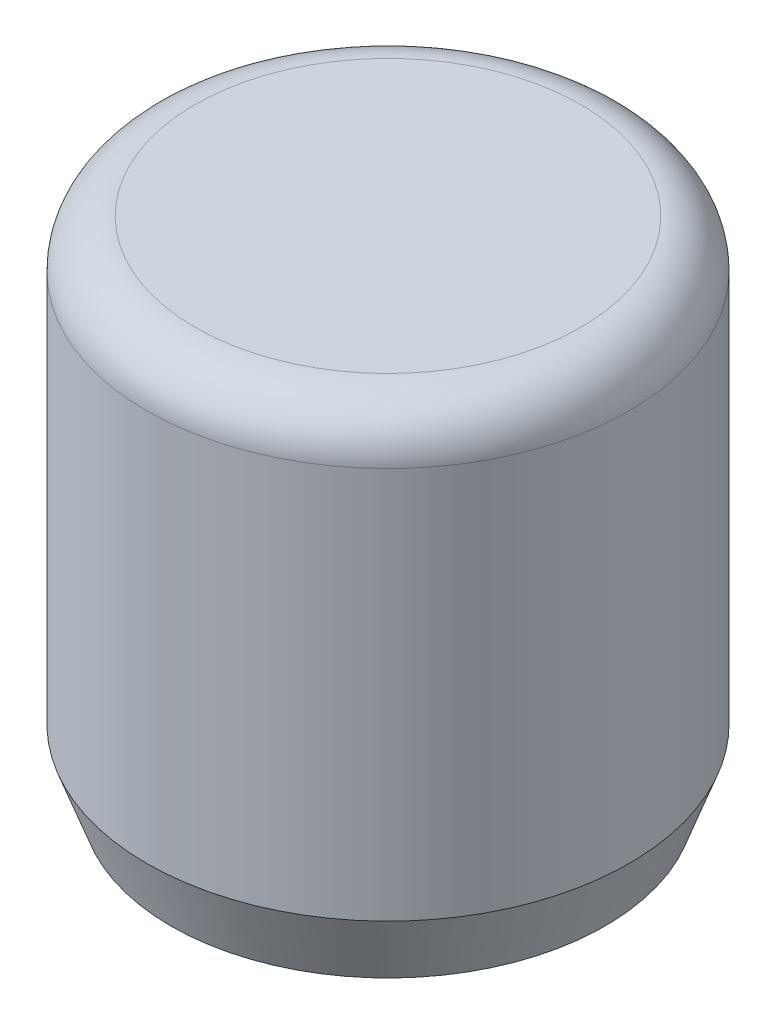
ISO-10303-21;
HEADER;
FILE_DESCRIPTION(('STEP AP214'),'2;1');
FILE_NAME('part.step','',(''),(''),'','','');
FILE_SCHEMA(('AUTOMOTIVE_DESIGN { 1 0 10303 214 1 1 1 1 }'));
ENDSEC;
DATA;
#1=APPLICATION_CONTEXT('core data for automotive mechanical design processes');
#2=APPLICATION_PROTOCOL_DEFINITION('international standard','automotive_design',2000,#1);
#3=PRODUCT_CONTEXT('',#1,'mechanical');
#4=PRODUCT('Part','Part','',(#3));
#5=PRODUCT_RELATED_PRODUCT_CATEGORY('part','',(#4));
#6=PRODUCT_DEFINITION_FORMATION('','',#4);
#7=PRODUCT_DEFINITION_CONTEXT('part definition',#1,'design');
#8=PRODUCT_DEFINITION('design','',#6,#7);
#9=PRODUCT_DEFINITION_SHAPE('','',#8);
#10=(LENGTH_UNIT() NAMED_UNIT(*) SI_UNIT(.MILLI.,.METRE.));
#11=(NAMED_UNIT(*) PLANE_ANGLE_UNIT() SI_UNIT($,.RADIAN.));
#12=(NAMED_UNIT(*) SI_UNIT($,.STERADIAN.) SOLID_ANGLE_UNIT());
#13=UNCERTAINTY_MEASURE_WITH_UNIT(LENGTH_MEASURE(1.E-05),#10,'distance_accuracy_value','');
#14=(GEOMETRIC_REPRESENTATION_CONTEXT(3) GLOBAL_UNCERTAINTY_ASSIGNED_CONTEXT((#13)) GLOBAL_UNIT_ASSIGNED_CONTEXT((#10,
#11,#12)) REPRESENTATION_CONTEXT('',''));
#15=CARTESIAN_POINT('',(0.,0.,0.));
#16=DIRECTION('',(0.,0.,1.));
#17=DIRECTION('',(1.,0.,0.));
#18=AXIS2_PLACEMENT_3D('',#15,#16,#17);
#19=CARTESIAN_POINT('',(0.,10.5,0.));
#20=DIRECTION('',(0.,-1.,0.));
#21=DIRECTION('',(0.,0.,-1.));
#22=AXIS2_PLACEMENT_3D('',#19,#20,#21);
#23=CYLINDRICAL_SURFACE('',#22,5.);
#24=CARTESIAN_POINT('',(0.,1.37373870972737,0.));
#25=DIRECTION('',(0.,1.,0.));
#26=DIRECTION('',(0.,0.,1.));
#27=AXIS2_PLACEMENT_3D('',#24,#25,#26);
#28=CIRCLE('',#27,5.);
#29=CARTESIAN_POINT('',(0.,1.37373870972737,5.));
#30=VERTEX_POINT('',#29);
#31=EDGE_CURVE('E40',#30,#30,#28,.T.);
#32=ORIENTED_EDGE('',*,*,#31,.T.);
#33=EDGE_LOOP('',(#32));
#34=FACE_BOUND('',#33,.T.);
#35=CARTESIAN_POINT('',(0.,9.5,0.));
#36=DIRECTION('',(0.,1.,0.));
#37=DIRECTION('',(0.,0.,1.));
#38=AXIS2_PLACEMENT_3D('',#35,#36,#37);
#39=CIRCLE('',#38,5.);
#40=CARTESIAN_POINT('',(0.,9.5,5.));
#41=VERTEX_POINT('',#40);
#42=EDGE_CURVE('E44',#41,#41,#39,.F.);
#43=ORIENTED_EDGE('',*,*,#42,.T.);
#44=EDGE_LOOP('',(#43));
#45=FACE_BOUND('',#44,.T.);
#46=ADVANCED_FACE('F33',(#34,#45),#23,.T.);
#47=CARTESIAN_POINT('',(0.,10.5,0.));
#48=DIRECTION('',(0.,1.,0.));
#49=DIRECTION('',(0.,0.,1.));
#50=AXIS2_PLACEMENT_3D('',#47,#48,#49);
#51=PLANE('',#50);
#52=CARTESIAN_POINT('',(0.,10.5,0.));
#53=DIRECTION('',(0.,1.,0.));
#54=DIRECTION('',(0.,0.,1.));
#55=AXIS2_PLACEMENT_3D('',#52,#53,#54);
#56=CIRCLE('',#55,4.);
#57=CARTESIAN_POINT('',(0.,10.5,4.));
#58=VERTEX_POINT('',#57);
#59=EDGE_CURVE('E48',#58,#58,#56,.T.);
#60=ORIENTED_EDGE('',*,*,#59,.T.);
#61=EDGE_LOOP('',(#60));
#62=FACE_BOUND('',#61,.T.);
#63=ADVANCED_FACE('F70',(#62),#51,.T.);
#64=CARTESIAN_POINT('',(0.,0.,0.));
#65=DIRECTION('',(0.,1.,0.));
#66=DIRECTION('',(0.,0.,1.));
#67=AXIS2_PLACEMENT_3D('',#64,#65,#66);
#68=PLANE('',#67);
#69=CARTESIAN_POINT('',(0.,0.,0.));
#70=DIRECTION('',(0.,1.,0.));
#71=DIRECTION('',(0.,0.,1.));
#72=AXIS2_PLACEMENT_3D('',#69,#70,#71);
#73=CIRCLE('',#72,4.49999999999998);
#74=CARTESIAN_POINT('',(0.,0.,4.49999999999998));
#75=VERTEX_POINT('',#74);
#76=EDGE_CURVE('E10',#75,#75,#73,.F.);
#77=ORIENTED_EDGE('',*,*,#76,.T.);
#78=EDGE_LOOP('',(#77));
#79=FACE_BOUND('',#78,.T.);
#80=CARTESIAN_POINT('',(0.,0.,0.));
#81=DIRECTION('',(0.,-1.,0.));
#82=DIRECTION('',(0.,0.,-1.));
#83=AXIS2_PLACEMENT_3D('',#80,#81,#82);
#84=CIRCLE('',#83,3.);
#85=CARTESIAN_POINT('',(0.,0.,-3.));
#86=VERTEX_POINT('',#85);
#87=EDGE_CURVE('E54',#86,#86,#84,.T.);
#88=ORIENTED_EDGE('',*,*,#87,.F.);
#89=EDGE_LOOP('',(#88));
#90=FACE_BOUND('',#89,.T.);
#91=ADVANCED_FACE('F65',(#79,#90),#68,.F.);
#92=CARTESIAN_POINT('',(0.,6.,0.));
#93=DIRECTION('',(0.,-1.,0.));
#94=DIRECTION('',(0.,0.,-1.));
#95=AXIS2_PLACEMENT_3D('',#92,#93,#94);
#96=CYLINDRICAL_SURFACE('',#95,3.);
#97=CARTESIAN_POINT('',(0.,6.,0.));
#98=DIRECTION('',(0.,-1.,0.));
#99=DIRECTION('',(0.,0.,-1.));
#100=AXIS2_PLACEMENT_3D('',#97,#98,#99);
#101=CIRCLE('',#100,3.);
#102=CARTESIAN_POINT('',(0.,6.,-3.));
#103=VERTEX_POINT('',#102);
#104=EDGE_CURVE('E53',#103,#103,#101,.T.);
#105=ORIENTED_EDGE('',*,*,#104,.F.);
#106=EDGE_LOOP('',(#105));
#107=FACE_BOUND('',#106,.T.);
#108=ORIENTED_EDGE('',*,*,#87,.T.);
#109=EDGE_LOOP('',(#108));
#110=FACE_BOUND('',#109,.T.);
#111=ADVANCED_FACE('F62',(#107,#110),#96,.F.);
#112=CARTESIAN_POINT('',(0.,6.,0.));
#113=DIRECTION('',(0.,-1.,0.));
#114=DIRECTION('',(0.,0.,-1.));
#115=AXIS2_PLACEMENT_3D('',#112,#113,#114);
#116=PLANE('',#115);
#117=ORIENTED_EDGE('',*,*,#104,.T.);
#118=EDGE_LOOP('',(#117));
#119=FACE_BOUND('',#118,.T.);
#120=ADVANCED_FACE('F60',(#119),#116,.T.);
#121=CARTESIAN_POINT('',(0.,9.5,0.));
#122=DIRECTION('',(0.,1.,0.));
#123=DIRECTION('',(0.,0.,1.));
#124=AXIS2_PLACEMENT_3D('',#121,#122,#123);
#125=TOROIDAL_SURFACE('',#124,4.,1.);
#126=ORIENTED_EDGE('',*,*,#42,.F.);
#127=EDGE_LOOP('',(#126));
#128=FACE_BOUND('',#127,.T.);
#129=ORIENTED_EDGE('',*,*,#59,.F.);
#130=EDGE_LOOP('',(#129));
#131=FACE_BOUND('',#130,.T.);
#132=ADVANCED_FACE('F82',(#128,#131),#125,.T.);
#133=CARTESIAN_POINT('',(0.,1.37373870972737,0.));
#134=DIRECTION('',(0.,1.,0.));
#135=DIRECTION('',(0.,0.,1.));
#136=AXIS2_PLACEMENT_3D('',#133,#134,#135);
#137=CONICAL_SURFACE('',#136,5.,0.349065850398866);
#138=ORIENTED_EDGE('',*,*,#76,.F.);
#139=EDGE_LOOP('',(#138));
#140=FACE_BOUND('',#139,.T.);
#141=ORIENTED_EDGE('',*,*,#31,.F.);
#142=EDGE_LOOP('',(#141));
#143=FACE_BOUND('',#142,.T.);
#144=ADVANCED_FACE('F35',(#140,#143),#137,.T.);
#145=CLOSED_SHELL('',(#46,#63,#91,#111,#120,#132,#144));
#146=MANIFOLD_SOLID_BREP('B2',#145);
#147=ADVANCED_BREP_SHAPE_REPRESENTATION('',(#18,#146),#14);
#148=SHAPE_DEFINITION_REPRESENTATION(#9,#147);
ENDSEC;
END-ISO-10303-21;
